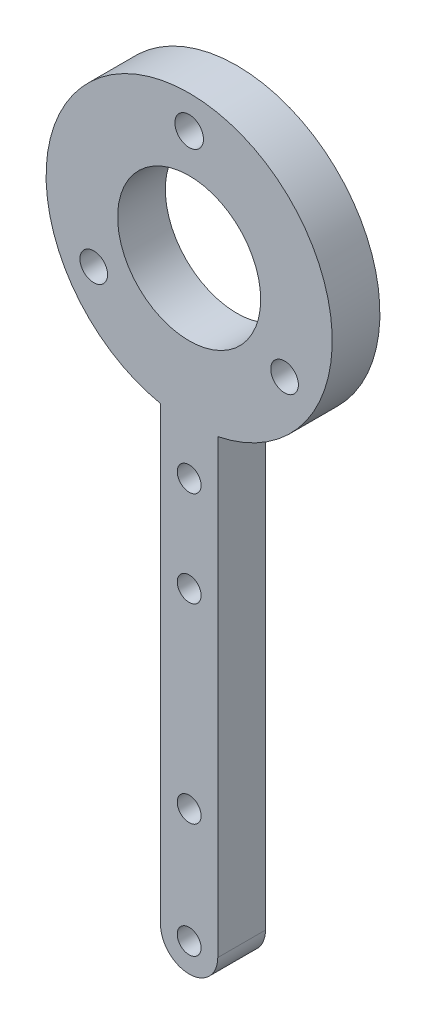
ISO-10303-21;
HEADER;
FILE_DESCRIPTION(('STEP AP214'),'2;1');
FILE_NAME('part.step','',(''),(''),'','','');
FILE_SCHEMA(('AUTOMOTIVE_DESIGN { 1 0 10303 214 1 1 1 1 }'));
ENDSEC;
DATA;
#1=APPLICATION_CONTEXT('core data for automotive mechanical design processes');
#2=APPLICATION_PROTOCOL_DEFINITION('international standard','automotive_design',2000,#1);
#3=PRODUCT_CONTEXT('',#1,'mechanical');
#4=PRODUCT('Part','Part','',(#3));
#5=PRODUCT_RELATED_PRODUCT_CATEGORY('part','',(#4));
#6=PRODUCT_DEFINITION_FORMATION('','',#4);
#7=PRODUCT_DEFINITION_CONTEXT('part definition',#1,'design');
#8=PRODUCT_DEFINITION('design','',#6,#7);
#9=PRODUCT_DEFINITION_SHAPE('','',#8);
#10=(LENGTH_UNIT() NAMED_UNIT(*) SI_UNIT(.MILLI.,.METRE.));
#11=(NAMED_UNIT(*) PLANE_ANGLE_UNIT() SI_UNIT($,.RADIAN.));
#12=(NAMED_UNIT(*) SI_UNIT($,.STERADIAN.) SOLID_ANGLE_UNIT());
#13=UNCERTAINTY_MEASURE_WITH_UNIT(LENGTH_MEASURE(1.E-05),#10,'distance_accuracy_value','');
#14=(GEOMETRIC_REPRESENTATION_CONTEXT(3) GLOBAL_UNCERTAINTY_ASSIGNED_CONTEXT((#13)) GLOBAL_UNIT_ASSIGNED_CONTEXT((#10,
#11,#12)) REPRESENTATION_CONTEXT('',''));
#15=CARTESIAN_POINT('',(0.,0.,0.));
#16=DIRECTION('',(0.,0.,1.));
#17=DIRECTION('',(1.,0.,0.));
#18=AXIS2_PLACEMENT_3D('',#15,#16,#17);
#19=CARTESIAN_POINT('',(3.,0.,5.));
#20=DIRECTION('',(1.,0.,0.));
#21=DIRECTION('',(0.,1.,0.));
#22=AXIS2_PLACEMENT_3D('',#19,#20,#21);
#23=PLANE('',#22);
#24=DIRECTION('',(0.,-1.,0.));
#25=VECTOR('',#24,1.);
#26=CARTESIAN_POINT('',(3.,0.,5.));
#27=LINE('',#26,#25);
#28=CARTESIAN_POINT('',(3.,-14.6969384566991,5.));
#29=VERTEX_POINT('',#28);
#30=CARTESIAN_POINT('',(3.00000000000001,-62.,5.));
#31=VERTEX_POINT('',#30);
#32=EDGE_CURVE('E88',#29,#31,#27,.T.);
#33=ORIENTED_EDGE('',*,*,#32,.T.);
#34=DIRECTION('',(0.,0.,-1.));
#35=VECTOR('',#34,1.);
#36=CARTESIAN_POINT('',(3.00000000000001,-62.,5.));
#37=LINE('',#36,#35);
#38=CARTESIAN_POINT('',(3.00000000000001,-62.,0.));
#39=VERTEX_POINT('',#38);
#40=EDGE_CURVE('E94',#31,#39,#37,.T.);
#41=ORIENTED_EDGE('',*,*,#40,.T.);
#42=DIRECTION('',(0.,-1.,0.));
#43=VECTOR('',#42,1.);
#44=CARTESIAN_POINT('',(3.,0.,0.));
#45=LINE('',#44,#43);
#46=CARTESIAN_POINT('',(3.,-14.6969384566991,0.));
#47=VERTEX_POINT('',#46);
#48=EDGE_CURVE('E91',#47,#39,#45,.T.);
#49=ORIENTED_EDGE('',*,*,#48,.F.);
#50=DIRECTION('',(0.,0.,-1.));
#51=VECTOR('',#50,1.);
#52=CARTESIAN_POINT('',(3.,-14.6969384566991,5.));
#53=LINE('',#52,#51);
#54=EDGE_CURVE('E84',#29,#47,#53,.T.);
#55=ORIENTED_EDGE('',*,*,#54,.F.);
#56=EDGE_LOOP('',(#33,#41,#49,#55));
#57=FACE_BOUND('',#56,.T.);
#58=ADVANCED_FACE('F37',(#57),#23,.T.);
#59=CARTESIAN_POINT('',(0.,0.,5.));
#60=DIRECTION('',(0.,0.,-1.));
#61=DIRECTION('',(-1.,0.,0.));
#62=AXIS2_PLACEMENT_3D('',#59,#60,#61);
#63=CYLINDRICAL_SURFACE('',#62,15.);
#64=CARTESIAN_POINT('',(0.,0.,0.));
#65=DIRECTION('',(0.,0.,1.));
#66=DIRECTION('',(1.,0.,0.));
#67=AXIS2_PLACEMENT_3D('',#64,#65,#66);
#68=CIRCLE('',#67,15.);
#69=CARTESIAN_POINT('',(-3.,-14.6969384566991,0.));
#70=VERTEX_POINT('',#69);
#71=EDGE_CURVE('E131',#47,#70,#68,.T.);
#72=ORIENTED_EDGE('',*,*,#71,.T.);
#73=DIRECTION('',(0.,0.,-1.));
#74=VECTOR('',#73,1.);
#75=CARTESIAN_POINT('',(-3.,-14.6969384566991,5.));
#76=LINE('',#75,#74);
#77=CARTESIAN_POINT('',(-3.,-14.6969384566991,5.));
#78=VERTEX_POINT('',#77);
#79=EDGE_CURVE('E95',#78,#70,#76,.T.);
#80=ORIENTED_EDGE('',*,*,#79,.F.);
#81=CARTESIAN_POINT('',(0.,0.,5.));
#82=DIRECTION('',(0.,0.,1.));
#83=DIRECTION('',(1.,0.,0.));
#84=AXIS2_PLACEMENT_3D('',#81,#82,#83);
#85=CIRCLE('',#84,15.);
#86=EDGE_CURVE('E98',#29,#78,#85,.T.);
#87=ORIENTED_EDGE('',*,*,#86,.F.);
#88=ORIENTED_EDGE('',*,*,#54,.T.);
#89=EDGE_LOOP('',(#72,#80,#87,#88));
#90=FACE_BOUND('',#89,.T.);
#91=ADVANCED_FACE('F99',(#90),#63,.T.);
#92=CARTESIAN_POINT('',(-3.,0.,5.));
#93=DIRECTION('',(1.,0.,0.));
#94=DIRECTION('',(0.,1.,0.));
#95=AXIS2_PLACEMENT_3D('',#92,#93,#94);
#96=PLANE('',#95);
#97=DIRECTION('',(0.,-1.,0.));
#98=VECTOR('',#97,1.);
#99=CARTESIAN_POINT('',(-3.,0.,0.));
#100=LINE('',#99,#98);
#101=CARTESIAN_POINT('',(-2.99999999999999,-62.,0.));
#102=VERTEX_POINT('',#101);
#103=EDGE_CURVE('E133',#70,#102,#100,.T.);
#104=ORIENTED_EDGE('',*,*,#103,.T.);
#105=DIRECTION('',(0.,0.,-1.));
#106=VECTOR('',#105,1.);
#107=CARTESIAN_POINT('',(-2.99999999999999,-62.,5.));
#108=LINE('',#107,#106);
#109=CARTESIAN_POINT('',(-2.99999999999999,-62.,5.));
#110=VERTEX_POINT('',#109);
#111=EDGE_CURVE('E45',#102,#110,#108,.F.);
#112=ORIENTED_EDGE('',*,*,#111,.T.);
#113=DIRECTION('',(0.,-1.,0.));
#114=VECTOR('',#113,1.);
#115=CARTESIAN_POINT('',(-3.,0.,5.));
#116=LINE('',#115,#114);
#117=EDGE_CURVE('E102',#78,#110,#116,.T.);
#118=ORIENTED_EDGE('',*,*,#117,.F.);
#119=ORIENTED_EDGE('',*,*,#79,.T.);
#120=EDGE_LOOP('',(#104,#112,#118,#119));
#121=FACE_BOUND('',#120,.T.);
#122=ADVANCED_FACE('F158',(#121),#96,.F.);
#123=CARTESIAN_POINT('',(-10.00259341371,-5.775,5.));
#124=DIRECTION('',(0.,0.,-1.));
#125=DIRECTION('',(-1.,0.,0.));
#126=AXIS2_PLACEMENT_3D('',#123,#124,#125);
#127=CYLINDRICAL_SURFACE('',#126,1.44999999999999);
#128=CARTESIAN_POINT('',(-10.00259341371,-5.775,5.));
#129=DIRECTION('',(0.,0.,1.));
#130=DIRECTION('',(1.,0.,0.));
#131=AXIS2_PLACEMENT_3D('',#128,#129,#130);
#132=CIRCLE('',#131,1.44999999999999);
#133=CARTESIAN_POINT('',(-8.55259341371002,-5.775,5.));
#134=VERTEX_POINT('',#133);
#135=EDGE_CURVE('E124',#134,#134,#132,.T.);
#136=ORIENTED_EDGE('',*,*,#135,.T.);
#137=EDGE_LOOP('',(#136));
#138=FACE_BOUND('',#137,.T.);
#139=CARTESIAN_POINT('',(-10.00259341371,-5.775,0.));
#140=DIRECTION('',(0.,0.,1.));
#141=DIRECTION('',(1.,0.,0.));
#142=AXIS2_PLACEMENT_3D('',#139,#140,#141);
#143=CIRCLE('',#142,1.44999999999999);
#144=CARTESIAN_POINT('',(-8.55259341371002,-5.775,0.));
#145=VERTEX_POINT('',#144);
#146=EDGE_CURVE('E111',#145,#145,#143,.T.);
#147=ORIENTED_EDGE('',*,*,#146,.F.);
#148=EDGE_LOOP('',(#147));
#149=FACE_BOUND('',#148,.T.);
#150=ADVANCED_FACE('F160',(#138,#149),#127,.F.);
#151=CARTESIAN_POINT('',(0.,11.55,5.));
#152=DIRECTION('',(0.,0.,-1.));
#153=DIRECTION('',(-1.,0.,0.));
#154=AXIS2_PLACEMENT_3D('',#151,#152,#153);
#155=CYLINDRICAL_SURFACE('',#154,1.49880382294785);
#156=CARTESIAN_POINT('',(0.,11.55,5.));
#157=DIRECTION('',(0.,0.,1.));
#158=DIRECTION('',(1.,0.,0.));
#159=AXIS2_PLACEMENT_3D('',#156,#157,#158);
#160=CIRCLE('',#159,1.49880382294785);
#161=CARTESIAN_POINT('',(1.49880382294785,11.55,5.));
#162=VERTEX_POINT('',#161);
#163=EDGE_CURVE('E121',#162,#162,#160,.T.);
#164=ORIENTED_EDGE('',*,*,#163,.T.);
#165=EDGE_LOOP('',(#164));
#166=FACE_BOUND('',#165,.T.);
#167=CARTESIAN_POINT('',(0.,11.55,0.));
#168=DIRECTION('',(0.,0.,1.));
#169=DIRECTION('',(1.,0.,0.));
#170=AXIS2_PLACEMENT_3D('',#167,#168,#169);
#171=CIRCLE('',#170,1.49880382294785);
#172=CARTESIAN_POINT('',(1.49880382294785,11.55,0.));
#173=VERTEX_POINT('',#172);
#174=EDGE_CURVE('E138',#173,#173,#171,.T.);
#175=ORIENTED_EDGE('',*,*,#174,.F.);
#176=EDGE_LOOP('',(#175));
#177=FACE_BOUND('',#176,.T.);
#178=ADVANCED_FACE('F166',(#166,#177),#155,.F.);
#179=CARTESIAN_POINT('',(10.00259341371,-5.775,5.));
#180=DIRECTION('',(0.,0.,-1.));
#181=DIRECTION('',(-1.,0.,0.));
#182=AXIS2_PLACEMENT_3D('',#179,#180,#181);
#183=CYLINDRICAL_SURFACE('',#182,1.44999999999999);
#184=CARTESIAN_POINT('',(10.00259341371,-5.775,5.));
#185=DIRECTION('',(0.,0.,1.));
#186=DIRECTION('',(1.,0.,0.));
#187=AXIS2_PLACEMENT_3D('',#184,#185,#186);
#188=CIRCLE('',#187,1.44999999999999);
#189=CARTESIAN_POINT('',(11.45259341371,-5.775,5.));
#190=VERTEX_POINT('',#189);
#191=EDGE_CURVE('E118',#190,#190,#188,.T.);
#192=ORIENTED_EDGE('',*,*,#191,.T.);
#193=EDGE_LOOP('',(#192));
#194=FACE_BOUND('',#193,.T.);
#195=CARTESIAN_POINT('',(10.00259341371,-5.775,0.));
#196=DIRECTION('',(0.,0.,1.));
#197=DIRECTION('',(1.,0.,0.));
#198=AXIS2_PLACEMENT_3D('',#195,#196,#197);
#199=CIRCLE('',#198,1.44999999999999);
#200=CARTESIAN_POINT('',(11.45259341371,-5.775,0.));
#201=VERTEX_POINT('',#200);
#202=EDGE_CURVE('E135',#201,#201,#199,.T.);
#203=ORIENTED_EDGE('',*,*,#202,.F.);
#204=EDGE_LOOP('',(#203));
#205=FACE_BOUND('',#204,.T.);
#206=ADVANCED_FACE('F194',(#194,#205),#183,.F.);
#207=CARTESIAN_POINT('',(0.,0.,5.));
#208=DIRECTION('',(0.,0.,-1.));
#209=DIRECTION('',(-1.,0.,0.));
#210=AXIS2_PLACEMENT_3D('',#207,#208,#209);
#211=CYLINDRICAL_SURFACE('',#210,7.5);
#212=CARTESIAN_POINT('',(0.,0.,5.));
#213=DIRECTION('',(0.,0.,1.));
#214=DIRECTION('',(1.,0.,0.));
#215=AXIS2_PLACEMENT_3D('',#212,#213,#214);
#216=CIRCLE('',#215,7.5);
#217=CARTESIAN_POINT('',(7.5,0.,5.));
#218=VERTEX_POINT('',#217);
#219=EDGE_CURVE('E127',#218,#218,#216,.T.);
#220=ORIENTED_EDGE('',*,*,#219,.T.);
#221=EDGE_LOOP('',(#220));
#222=FACE_BOUND('',#221,.T.);
#223=CARTESIAN_POINT('',(0.,0.,0.));
#224=DIRECTION('',(0.,0.,1.));
#225=DIRECTION('',(1.,0.,0.));
#226=AXIS2_PLACEMENT_3D('',#223,#224,#225);
#227=CIRCLE('',#226,7.5);
#228=CARTESIAN_POINT('',(7.5,0.,0.));
#229=VERTEX_POINT('',#228);
#230=EDGE_CURVE('E108',#229,#229,#227,.T.);
#231=ORIENTED_EDGE('',*,*,#230,.F.);
#232=EDGE_LOOP('',(#231));
#233=FACE_BOUND('',#232,.T.);
#234=ADVANCED_FACE('F186',(#222,#233),#211,.F.);
#235=CARTESIAN_POINT('',(0.,0.,5.));
#236=DIRECTION('',(0.,0.,1.));
#237=DIRECTION('',(1.,0.,0.));
#238=AXIS2_PLACEMENT_3D('',#235,#236,#237);
#239=PLANE('',#238);
#240=CARTESIAN_POINT('',(0.,-62.,5.));
#241=DIRECTION('',(0.,0.,1.));
#242=DIRECTION('',(1.,0.,0.));
#243=AXIS2_PLACEMENT_3D('',#240,#241,#242);
#244=CIRCLE('',#243,1.25);
#245=CARTESIAN_POINT('',(1.25,-62.,5.));
#246=VERTEX_POINT('',#245);
#247=EDGE_CURVE('E287',#246,#246,#244,.T.);
#248=ORIENTED_EDGE('',*,*,#247,.F.);
#249=EDGE_LOOP('',(#248));
#250=FACE_BOUND('',#249,.T.);
#251=CARTESIAN_POINT('',(0.,-50.,5.));
#252=DIRECTION('',(0.,0.,1.));
#253=DIRECTION('',(1.,0.,0.));
#254=AXIS2_PLACEMENT_3D('',#251,#252,#253);
#255=CIRCLE('',#254,1.25);
#256=CARTESIAN_POINT('',(1.25,-50.,5.));
#257=VERTEX_POINT('',#256);
#258=EDGE_CURVE('E290',#257,#257,#255,.T.);
#259=ORIENTED_EDGE('',*,*,#258,.F.);
#260=EDGE_LOOP('',(#259));
#261=FACE_BOUND('',#260,.T.);
#262=CARTESIAN_POINT('',(0.,-30.,5.));
#263=DIRECTION('',(0.,0.,1.));
#264=DIRECTION('',(1.,0.,0.));
#265=AXIS2_PLACEMENT_3D('',#262,#263,#264);
#266=CIRCLE('',#265,1.25);
#267=CARTESIAN_POINT('',(1.25,-30.,5.));
#268=VERTEX_POINT('',#267);
#269=EDGE_CURVE('E299',#268,#268,#266,.T.);
#270=ORIENTED_EDGE('',*,*,#269,.F.);
#271=EDGE_LOOP('',(#270));
#272=FACE_BOUND('',#271,.T.);
#273=CARTESIAN_POINT('',(0.,-20.,5.));
#274=DIRECTION('',(0.,0.,1.));
#275=DIRECTION('',(1.,0.,0.));
#276=AXIS2_PLACEMENT_3D('',#273,#274,#275);
#277=CIRCLE('',#276,1.25);
#278=CARTESIAN_POINT('',(1.25,-20.,5.));
#279=VERTEX_POINT('',#278);
#280=EDGE_CURVE('E304',#279,#279,#277,.T.);
#281=ORIENTED_EDGE('',*,*,#280,.F.);
#282=EDGE_LOOP('',(#281));
#283=FACE_BOUND('',#282,.T.);
#284=ORIENTED_EDGE('',*,*,#117,.T.);
#285=CARTESIAN_POINT('',(0.,-62.,5.));
#286=DIRECTION('',(0.,0.,1.));
#287=DIRECTION('',(1.,0.,0.));
#288=AXIS2_PLACEMENT_3D('',#285,#286,#287);
#289=CIRCLE('',#288,3.);
#290=CARTESIAN_POINT('',(0.,-65.,5.));
#291=VERTEX_POINT('',#290);
#292=EDGE_CURVE('E11',#110,#291,#289,.T.);
#293=ORIENTED_EDGE('',*,*,#292,.T.);
#294=CARTESIAN_POINT('',(0.,-62.,5.));
#295=DIRECTION('',(0.,0.,1.));
#296=DIRECTION('',(1.,0.,0.));
#297=AXIS2_PLACEMENT_3D('',#294,#295,#296);
#298=CIRCLE('',#297,3.);
#299=EDGE_CURVE('E107',#291,#31,#298,.T.);
#300=ORIENTED_EDGE('',*,*,#299,.T.);
#301=ORIENTED_EDGE('',*,*,#32,.F.);
#302=ORIENTED_EDGE('',*,*,#86,.T.);
#303=EDGE_LOOP('',(#284,#293,#300,#301,#302));
#304=FACE_BOUND('',#303,.T.);
#305=ORIENTED_EDGE('',*,*,#191,.F.);
#306=EDGE_LOOP('',(#305));
#307=FACE_BOUND('',#306,.T.);
#308=ORIENTED_EDGE('',*,*,#163,.F.);
#309=EDGE_LOOP('',(#308));
#310=FACE_BOUND('',#309,.T.);
#311=ORIENTED_EDGE('',*,*,#135,.F.);
#312=EDGE_LOOP('',(#311));
#313=FACE_BOUND('',#312,.T.);
#314=ORIENTED_EDGE('',*,*,#219,.F.);
#315=EDGE_LOOP('',(#314));
#316=FACE_BOUND('',#315,.T.);
#317=ADVANCED_FACE('F104',(#250,#261,#272,#283,#304,#307,#310,#313,#316),#239,.T.);
#318=CARTESIAN_POINT('',(0.,0.,0.));
#319=DIRECTION('',(0.,0.,1.));
#320=DIRECTION('',(1.,0.,0.));
#321=AXIS2_PLACEMENT_3D('',#318,#319,#320);
#322=PLANE('',#321);
#323=CARTESIAN_POINT('',(0.,-62.,0.));
#324=DIRECTION('',(0.,0.,1.));
#325=DIRECTION('',(1.,0.,0.));
#326=AXIS2_PLACEMENT_3D('',#323,#324,#325);
#327=CIRCLE('',#326,1.25);
#328=CARTESIAN_POINT('',(1.25,-62.,0.));
#329=VERTEX_POINT('',#328);
#330=EDGE_CURVE('E289',#329,#329,#327,.F.);
#331=ORIENTED_EDGE('',*,*,#330,.F.);
#332=EDGE_LOOP('',(#331));
#333=FACE_BOUND('',#332,.T.);
#334=CARTESIAN_POINT('',(0.,-50.,0.));
#335=DIRECTION('',(0.,0.,1.));
#336=DIRECTION('',(1.,0.,0.));
#337=AXIS2_PLACEMENT_3D('',#334,#335,#336);
#338=CIRCLE('',#337,1.25);
#339=CARTESIAN_POINT('',(1.25,-50.,0.));
#340=VERTEX_POINT('',#339);
#341=EDGE_CURVE('E293',#340,#340,#338,.F.);
#342=ORIENTED_EDGE('',*,*,#341,.F.);
#343=EDGE_LOOP('',(#342));
#344=FACE_BOUND('',#343,.T.);
#345=CARTESIAN_POINT('',(0.,-30.,0.));
#346=DIRECTION('',(0.,0.,1.));
#347=DIRECTION('',(1.,0.,0.));
#348=AXIS2_PLACEMENT_3D('',#345,#346,#347);
#349=CIRCLE('',#348,1.25);
#350=CARTESIAN_POINT('',(1.25,-30.,0.));
#351=VERTEX_POINT('',#350);
#352=EDGE_CURVE('E302',#351,#351,#349,.F.);
#353=ORIENTED_EDGE('',*,*,#352,.F.);
#354=EDGE_LOOP('',(#353));
#355=FACE_BOUND('',#354,.T.);
#356=CARTESIAN_POINT('',(0.,-20.,0.));
#357=DIRECTION('',(0.,0.,1.));
#358=DIRECTION('',(1.,0.,0.));
#359=AXIS2_PLACEMENT_3D('',#356,#357,#358);
#360=CIRCLE('',#359,1.25);
#361=CARTESIAN_POINT('',(1.25,-20.,0.));
#362=VERTEX_POINT('',#361);
#363=EDGE_CURVE('E114',#362,#362,#360,.F.);
#364=ORIENTED_EDGE('',*,*,#363,.F.);
#365=EDGE_LOOP('',(#364));
#366=FACE_BOUND('',#365,.T.);
#367=CARTESIAN_POINT('',(0.,-62.,0.));
#368=DIRECTION('',(0.,0.,1.));
#369=DIRECTION('',(1.,0.,0.));
#370=AXIS2_PLACEMENT_3D('',#367,#368,#369);
#371=CIRCLE('',#370,3.);
#372=CARTESIAN_POINT('',(0.,-65.,0.));
#373=VERTEX_POINT('',#372);
#374=EDGE_CURVE('E145',#39,#373,#371,.F.);
#375=ORIENTED_EDGE('',*,*,#374,.T.);
#376=CARTESIAN_POINT('',(0.,-62.,0.));
#377=DIRECTION('',(0.,0.,1.));
#378=DIRECTION('',(1.,0.,0.));
#379=AXIS2_PLACEMENT_3D('',#376,#377,#378);
#380=CIRCLE('',#379,3.);
#381=EDGE_CURVE('E59',#373,#102,#380,.F.);
#382=ORIENTED_EDGE('',*,*,#381,.T.);
#383=ORIENTED_EDGE('',*,*,#103,.F.);
#384=ORIENTED_EDGE('',*,*,#71,.F.);
#385=ORIENTED_EDGE('',*,*,#48,.T.);
#386=EDGE_LOOP('',(#375,#382,#383,#384,#385));
#387=FACE_BOUND('',#386,.T.);
#388=ORIENTED_EDGE('',*,*,#202,.T.);
#389=EDGE_LOOP('',(#388));
#390=FACE_BOUND('',#389,.T.);
#391=ORIENTED_EDGE('',*,*,#174,.T.);
#392=EDGE_LOOP('',(#391));
#393=FACE_BOUND('',#392,.T.);
#394=ORIENTED_EDGE('',*,*,#146,.T.);
#395=EDGE_LOOP('',(#394));
#396=FACE_BOUND('',#395,.T.);
#397=ORIENTED_EDGE('',*,*,#230,.T.);
#398=EDGE_LOOP('',(#397));
#399=FACE_BOUND('',#398,.T.);
#400=ADVANCED_FACE('F156',(#333,#344,#355,#366,#387,#390,#393,#396,#399),#322,.F.);
#401=CARTESIAN_POINT('',(0.,-62.,5.));
#402=DIRECTION('',(0.,0.,-1.));
#403=DIRECTION('',(-1.,0.,0.));
#404=AXIS2_PLACEMENT_3D('',#401,#402,#403);
#405=CYLINDRICAL_SURFACE('',#404,3.);
#406=ORIENTED_EDGE('',*,*,#299,.F.);
#407=DIRECTION('',(0.,0.,-1.));
#408=VECTOR('',#407,1.);
#409=CARTESIAN_POINT('',(0.,-65.,5.));
#410=LINE('',#409,#408);
#411=EDGE_CURVE('E147',#373,#291,#410,.F.);
#412=ORIENTED_EDGE('',*,*,#411,.F.);
#413=ORIENTED_EDGE('',*,*,#374,.F.);
#414=ORIENTED_EDGE('',*,*,#40,.F.);
#415=EDGE_LOOP('',(#406,#412,#413,#414));
#416=FACE_BOUND('',#415,.T.);
#417=ADVANCED_FACE('F155',(#416),#405,.T.);
#418=CARTESIAN_POINT('',(0.,-62.,5.));
#419=DIRECTION('',(0.,0.,1.));
#420=DIRECTION('',(1.,0.,0.));
#421=AXIS2_PLACEMENT_3D('',#418,#419,#420);
#422=CYLINDRICAL_SURFACE('',#421,3.);
#423=ORIENTED_EDGE('',*,*,#292,.F.);
#424=ORIENTED_EDGE('',*,*,#111,.F.);
#425=ORIENTED_EDGE('',*,*,#381,.F.);
#426=ORIENTED_EDGE('',*,*,#411,.T.);
#427=EDGE_LOOP('',(#423,#424,#425,#426));
#428=FACE_BOUND('',#427,.T.);
#429=ADVANCED_FACE('F39',(#428),#422,.T.);
#430=CARTESIAN_POINT('',(0.,-20.,-0.00100000000000013));
#431=DIRECTION('',(0.,0.,1.));
#432=DIRECTION('',(1.,0.,0.));
#433=AXIS2_PLACEMENT_3D('',#430,#431,#432);
#434=CYLINDRICAL_SURFACE('',#433,1.25);
#435=ORIENTED_EDGE('',*,*,#280,.T.);
#436=EDGE_LOOP('',(#435));
#437=FACE_BOUND('',#436,.T.);
#438=ORIENTED_EDGE('',*,*,#363,.T.);
#439=EDGE_LOOP('',(#438));
#440=FACE_BOUND('',#439,.T.);
#441=ADVANCED_FACE('F180',(#437,#440),#434,.F.);
#442=CARTESIAN_POINT('',(0.,-30.,-0.00100000000000013));
#443=DIRECTION('',(0.,0.,1.));
#444=DIRECTION('',(1.,0.,0.));
#445=AXIS2_PLACEMENT_3D('',#442,#443,#444);
#446=CYLINDRICAL_SURFACE('',#445,1.25);
#447=ORIENTED_EDGE('',*,*,#269,.T.);
#448=EDGE_LOOP('',(#447));
#449=FACE_BOUND('',#448,.T.);
#450=ORIENTED_EDGE('',*,*,#352,.T.);
#451=EDGE_LOOP('',(#450));
#452=FACE_BOUND('',#451,.T.);
#453=ADVANCED_FACE('F251',(#449,#452),#446,.F.);
#454=CARTESIAN_POINT('',(0.,-50.,-0.00100000000000013));
#455=DIRECTION('',(0.,0.,1.));
#456=DIRECTION('',(1.,0.,0.));
#457=AXIS2_PLACEMENT_3D('',#454,#455,#456);
#458=CYLINDRICAL_SURFACE('',#457,1.25);
#459=ORIENTED_EDGE('',*,*,#258,.T.);
#460=EDGE_LOOP('',(#459));
#461=FACE_BOUND('',#460,.T.);
#462=ORIENTED_EDGE('',*,*,#341,.T.);
#463=EDGE_LOOP('',(#462));
#464=FACE_BOUND('',#463,.T.);
#465=ADVANCED_FACE('F260',(#461,#464),#458,.F.);
#466=CARTESIAN_POINT('',(0.,-62.,-0.00100000000000013));
#467=DIRECTION('',(0.,0.,1.));
#468=DIRECTION('',(1.,0.,0.));
#469=AXIS2_PLACEMENT_3D('',#466,#467,#468);
#470=CYLINDRICAL_SURFACE('',#469,1.25);
#471=ORIENTED_EDGE('',*,*,#247,.T.);
#472=EDGE_LOOP('',(#471));
#473=FACE_BOUND('',#472,.T.);
#474=ORIENTED_EDGE('',*,*,#330,.T.);
#475=EDGE_LOOP('',(#474));
#476=FACE_BOUND('',#475,.T.);
#477=ADVANCED_FACE('F270',(#473,#476),#470,.F.);
#478=CLOSED_SHELL('',(#58,#91,#122,#150,#178,#206,#234,#317,#400,#417,#429,#441,#453,#465,#477));
#479=MANIFOLD_SOLID_BREP('B2',#478);
#480=ADVANCED_BREP_SHAPE_REPRESENTATION('',(#18,#479),#14);
#481=SHAPE_DEFINITION_REPRESENTATION(#9,#480);
ENDSEC;
END-ISO-10303-21;
